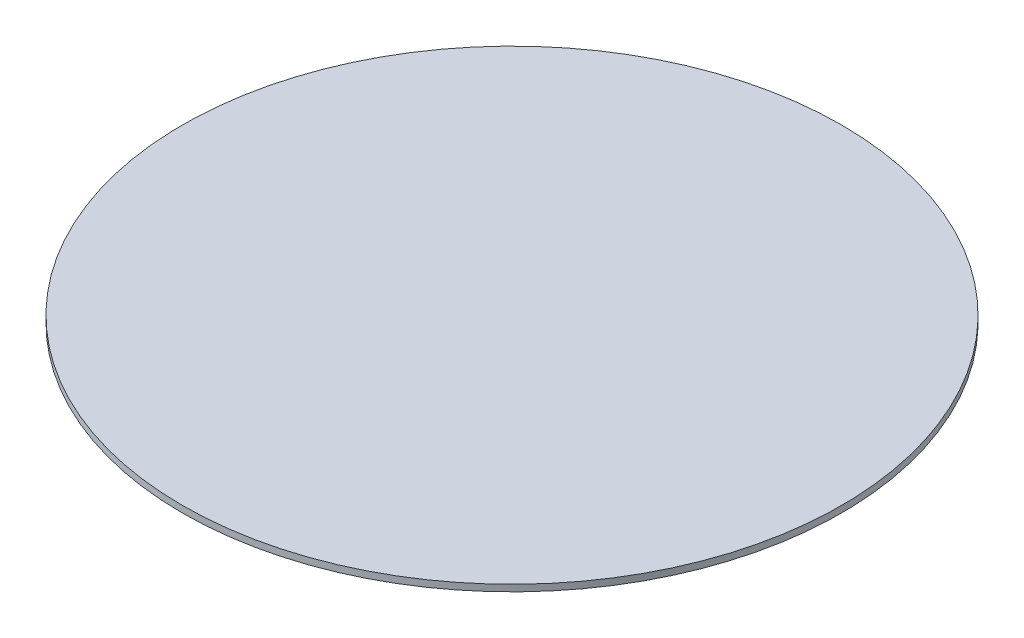
ISO-10303-21;
HEADER;
FILE_DESCRIPTION(('STEP AP214'),'2;1');
FILE_NAME('part.step','',(''),(''),'','','');
FILE_SCHEMA(('AUTOMOTIVE_DESIGN { 1 0 10303 214 1 1 1 1 }'));
ENDSEC;
DATA;
#1=APPLICATION_CONTEXT('core data for automotive mechanical design processes');
#2=APPLICATION_PROTOCOL_DEFINITION('international standard','automotive_design',2000,#1);
#3=PRODUCT_CONTEXT('',#1,'mechanical');
#4=PRODUCT('Part','Part','',(#3));
#5=PRODUCT_RELATED_PRODUCT_CATEGORY('part','',(#4));
#6=PRODUCT_DEFINITION_FORMATION('','',#4);
#7=PRODUCT_DEFINITION_CONTEXT('part definition',#1,'design');
#8=PRODUCT_DEFINITION('design','',#6,#7);
#9=PRODUCT_DEFINITION_SHAPE('','',#8);
#10=(LENGTH_UNIT() NAMED_UNIT(*) SI_UNIT(.MILLI.,.METRE.));
#11=(NAMED_UNIT(*) PLANE_ANGLE_UNIT() SI_UNIT($,.RADIAN.));
#12=(NAMED_UNIT(*) SI_UNIT($,.STERADIAN.) SOLID_ANGLE_UNIT());
#13=UNCERTAINTY_MEASURE_WITH_UNIT(LENGTH_MEASURE(1.E-05),#10,'distance_accuracy_value','');
#14=(GEOMETRIC_REPRESENTATION_CONTEXT(3) GLOBAL_UNCERTAINTY_ASSIGNED_CONTEXT((#13)) GLOBAL_UNIT_ASSIGNED_CONTEXT((#10,
#11,#12)) REPRESENTATION_CONTEXT('',''));
#15=CARTESIAN_POINT('',(0.,0.,0.));
#16=DIRECTION('',(0.,0.,1.));
#17=DIRECTION('',(1.,0.,0.));
#18=AXIS2_PLACEMENT_3D('',#15,#16,#17);
#19=CARTESIAN_POINT('',(0.,0.5,0.));
#20=DIRECTION('',(0.,-1.,0.));
#21=DIRECTION('',(0.,0.,-1.));
#22=AXIS2_PLACEMENT_3D('',#19,#20,#21);
#23=CYLINDRICAL_SURFACE('',#22,25.);
#24=CARTESIAN_POINT('',(0.,0.5,0.));
#25=DIRECTION('',(0.,1.,0.));
#26=DIRECTION('',(0.,0.,1.));
#27=AXIS2_PLACEMENT_3D('',#24,#25,#26);
#28=CIRCLE('',#27,25.);
#29=CARTESIAN_POINT('',(0.,0.5,25.));
#30=VERTEX_POINT('',#29);
#31=EDGE_CURVE('E10',#30,#30,#28,.T.);
#32=ORIENTED_EDGE('',*,*,#31,.F.);
#33=EDGE_LOOP('',(#32));
#34=FACE_BOUND('',#33,.T.);
#35=CARTESIAN_POINT('',(0.,0.,0.));
#36=DIRECTION('',(0.,1.,0.));
#37=DIRECTION('',(0.,0.,1.));
#38=AXIS2_PLACEMENT_3D('',#35,#36,#37);
#39=CIRCLE('',#38,25.);
#40=CARTESIAN_POINT('',(0.,0.,25.));
#41=VERTEX_POINT('',#40);
#42=EDGE_CURVE('E42',#41,#41,#39,.T.);
#43=ORIENTED_EDGE('',*,*,#42,.T.);
#44=EDGE_LOOP('',(#43));
#45=FACE_BOUND('',#44,.T.);
#46=ADVANCED_FACE('F39',(#34,#45),#23,.T.);
#47=CARTESIAN_POINT('',(0.,0.5,0.));
#48=DIRECTION('',(0.,1.,0.));
#49=DIRECTION('',(0.,0.,1.));
#50=AXIS2_PLACEMENT_3D('',#47,#48,#49);
#51=PLANE('',#50);
#52=ORIENTED_EDGE('',*,*,#31,.T.);
#53=EDGE_LOOP('',(#52));
#54=FACE_BOUND('',#53,.T.);
#55=ADVANCED_FACE('F56',(#54),#51,.T.);
#56=CARTESIAN_POINT('',(0.,0.,0.));
#57=DIRECTION('',(0.,1.,0.));
#58=DIRECTION('',(0.,0.,1.));
#59=AXIS2_PLACEMENT_3D('',#56,#57,#58);
#60=PLANE('',#59);
#61=ORIENTED_EDGE('',*,*,#42,.F.);
#62=EDGE_LOOP('',(#61));
#63=FACE_BOUND('',#62,.T.);
#64=ADVANCED_FACE('F54',(#63),#60,.F.);
#65=CLOSED_SHELL('',(#46,#55,#64));
#66=MANIFOLD_SOLID_BREP('B2',#65);
#67=ADVANCED_BREP_SHAPE_REPRESENTATION('',(#18,#66),#14);
#68=SHAPE_DEFINITION_REPRESENTATION(#9,#67);
ENDSEC;
END-ISO-10303-21;
